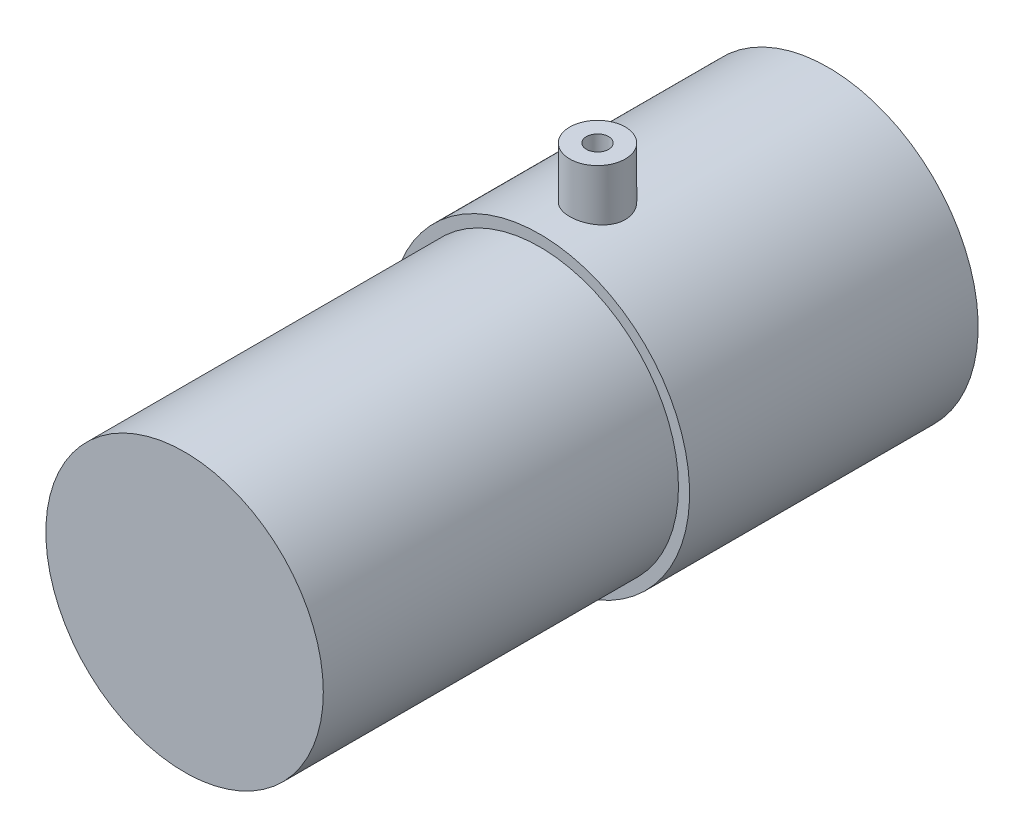
ISO-10303-21;
HEADER;
FILE_DESCRIPTION(('STEP AP214'),'2;1');
FILE_NAME('part.step','',(''),(''),'','','');
FILE_SCHEMA(('AUTOMOTIVE_DESIGN { 1 0 10303 214 1 1 1 1 }'));
ENDSEC;
DATA;
#1=APPLICATION_CONTEXT('core data for automotive mechanical design processes');
#2=APPLICATION_PROTOCOL_DEFINITION('international standard','automotive_design',2000,#1);
#3=PRODUCT_CONTEXT('',#1,'mechanical');
#4=PRODUCT('Part','Part','',(#3));
#5=PRODUCT_RELATED_PRODUCT_CATEGORY('part','',(#4));
#6=PRODUCT_DEFINITION_FORMATION('','',#4);
#7=PRODUCT_DEFINITION_CONTEXT('part definition',#1,'design');
#8=PRODUCT_DEFINITION('design','',#6,#7);
#9=PRODUCT_DEFINITION_SHAPE('','',#8);
#10=(LENGTH_UNIT() NAMED_UNIT(*) SI_UNIT(.MILLI.,.METRE.));
#11=(NAMED_UNIT(*) PLANE_ANGLE_UNIT() SI_UNIT($,.RADIAN.));
#12=(NAMED_UNIT(*) SI_UNIT($,.STERADIAN.) SOLID_ANGLE_UNIT());
#13=UNCERTAINTY_MEASURE_WITH_UNIT(LENGTH_MEASURE(1.E-05),#10,'distance_accuracy_value','');
#14=(GEOMETRIC_REPRESENTATION_CONTEXT(3) GLOBAL_UNCERTAINTY_ASSIGNED_CONTEXT((#13)) GLOBAL_UNIT_ASSIGNED_CONTEXT((#10,
#11,#12)) REPRESENTATION_CONTEXT('',''));
#15=CARTESIAN_POINT('',(0.,0.,0.));
#16=DIRECTION('',(0.,0.,1.));
#17=DIRECTION('',(1.,0.,0.));
#18=AXIS2_PLACEMENT_3D('',#15,#16,#17);
#19=CARTESIAN_POINT('',(0.,0.,0.));
#20=DIRECTION('',(0.,0.,1.));
#21=DIRECTION('',(1.,0.,0.));
#22=AXIS2_PLACEMENT_3D('',#19,#20,#21);
#23=PLANE('',#22);
#24=CARTESIAN_POINT('',(0.,0.,0.));
#25=DIRECTION('',(0.,0.,1.));
#26=DIRECTION('',(1.,0.,0.));
#27=AXIS2_PLACEMENT_3D('',#24,#25,#26);
#28=CIRCLE('',#27,1.);
#29=CARTESIAN_POINT('',(1.,0.,0.));
#30=VERTEX_POINT('',#29);
#31=EDGE_CURVE('E18',#30,#30,#28,.F.);
#32=ORIENTED_EDGE('',*,*,#31,.T.);
#33=EDGE_LOOP('',(#32));
#34=FACE_BOUND('',#33,.T.);
#35=ADVANCED_FACE('F15',(#34),#23,.F.);
#36=CARTESIAN_POINT('',(0.,0.,58.));
#37=DIRECTION('',(0.,0.,-1.));
#38=DIRECTION('',(-1.,0.,0.));
#39=AXIS2_PLACEMENT_3D('',#36,#37,#38);
#40=CYLINDRICAL_SURFACE('',#39,13.5);
#41=CARTESIAN_POINT('',(-7.28874342426864E-13,13.5,21.793969916197));
#42=CARTESIAN_POINT('',(0.0560547187778215,13.4999992255203,21.793965350852));
#43=CARTESIAN_POINT('',(0.112158286576555,13.4996470017555,21.7892393456204));
#44=CARTESIAN_POINT('',(0.222864894987266,13.4982743908674,21.7704407087432));
#45=CARTESIAN_POINT('',(0.277464499915154,13.4972525878948,21.7563482705365));
#46=CARTESIAN_POINT('',(0.383471550877165,13.4946566357918,21.7192259392802));
#47=CARTESIAN_POINT('',(0.434881875906202,13.4930829936095,21.696204247052));
#48=CARTESIAN_POINT('',(0.533083295219665,13.4895603799413,21.6418908434397));
#49=CARTESIAN_POINT('',(0.579876469092308,13.487611578607,21.6106028787952));
#50=CARTESIAN_POINT('',(0.667642209490378,13.4835526003134,21.5405698719629));
#51=CARTESIAN_POINT('',(0.708603537213994,13.4814421235002,21.5018107611579));
#52=CARTESIAN_POINT('',(0.783447763973924,13.4773001119936,21.417963488371));
#53=CARTESIAN_POINT('',(0.817330019927897,13.4752685844857,21.3728747520101));
#54=CARTESIAN_POINT('',(0.877086223697667,13.4715114384076,21.2775873611411));
#55=CARTESIAN_POINT('',(0.902951123598687,13.4697861663903,21.2273830177131));
#56=CARTESIAN_POINT('',(0.94588027163478,13.4668398746583,21.123329698313));
#57=CARTESIAN_POINT('',(0.962944722595264,13.4656188433223,21.0694808063695));
#58=CARTESIAN_POINT('',(0.987758440664013,13.4638214992336,20.9597720438277));
#59=CARTESIAN_POINT('',(0.995524858159425,13.4632439996121,20.9039160720331));
#60=CARTESIAN_POINT('',(1.00157500974734,13.4627952955316,20.7916904572035));
#61=CARTESIAN_POINT('',(0.999858870982531,13.4629240816027,20.735320821066));
#62=CARTESIAN_POINT('',(0.98700685017014,13.4638723229121,20.6237858446279));
#63=CARTESIAN_POINT('',(0.975889654976167,13.4646904079916,20.568618337792));
#64=CARTESIAN_POINT('',(0.944579934500234,13.4669229220615,20.4609340342315));
#65=CARTESIAN_POINT('',(0.924387252238211,13.468337361367,20.4084172833749));
#66=CARTESIAN_POINT('',(0.875477856895964,13.4716048357392,20.3074642984706));
#67=CARTESIAN_POINT('',(0.846752420833965,13.4734583192434,20.2590323056164));
#68=CARTESIAN_POINT('',(0.781601916279506,13.4773943974824,20.167674495549));
#69=CARTESIAN_POINT('',(0.745177372059709,13.4794769766123,20.1247483037367));
#70=CARTESIAN_POINT('',(0.665564669335613,13.4836424068129,20.0455149404205));
#71=CARTESIAN_POINT('',(0.622361678291855,13.4857252482279,20.00922267143));
#72=CARTESIAN_POINT('',(0.530445291464063,13.4896530825154,19.9443866893257));
#73=CARTESIAN_POINT('',(0.481729331139318,13.4914979638318,19.9158466035615));
#74=CARTESIAN_POINT('',(0.380143389175563,13.4947425193415,19.8673285849155));
#75=CARTESIAN_POINT('',(0.327269690363301,13.4961417893669,19.8473584192496));
#76=CARTESIAN_POINT('',(0.21899399506794,13.4983316458806,19.8166281855857));
#77=CARTESIAN_POINT('',(0.163597635331186,13.4991235250531,19.8058485522787));
#78=CARTESIAN_POINT('',(0.0719580842475888,13.4998561237979,19.7959102757375));
#79=CARTESIAN_POINT('',(0.0359891101357368,13.5000004972433,19.7939669850842));
#80=CARTESIAN_POINT('',(-0.0560547187785523,13.4999992255203,19.7939744815421));
#81=CARTESIAN_POINT('',(-0.112158286577282,13.4996470017555,19.7987004867738));
#82=CARTESIAN_POINT('',(-0.222864894987979,13.4982743908674,19.817499123651));
#83=CARTESIAN_POINT('',(-0.277464499915857,13.4972525878947,19.8315915618577));
#84=CARTESIAN_POINT('',(-0.383471550877841,13.4946566357918,19.8687138931142));
#85=CARTESIAN_POINT('',(-0.434881875906862,13.4930829936094,19.8917355853424));
#86=CARTESIAN_POINT('',(-0.533083295220286,13.4895603799413,19.9460489889548));
#87=CARTESIAN_POINT('',(-0.579876469092906,13.487611578607,19.9773369535993));
#88=CARTESIAN_POINT('',(-0.667642209490926,13.4835526003134,20.0473699604316));
#89=CARTESIAN_POINT('',(-0.708603537214513,13.4814421235002,20.0861290712367));
#90=CARTESIAN_POINT('',(-0.783447763974382,13.4773001119936,20.1699763440236));
#91=CARTESIAN_POINT('',(-0.817330019928321,13.4752685844857,20.2150650803846));
#92=CARTESIAN_POINT('',(-0.877086223698022,13.4715114384075,20.3103524712537));
#93=CARTESIAN_POINT('',(-0.902951123599006,13.4697861663903,20.3605568146816));
#94=CARTESIAN_POINT('',(-0.945880271635022,13.4668398746582,20.4646101340818));
#95=CARTESIAN_POINT('',(-0.962944722595466,13.4656188433222,20.5184590260252));
#96=CARTESIAN_POINT('',(-0.987758440664135,13.4638214992336,20.628167788567));
#97=CARTESIAN_POINT('',(-0.995524858159506,13.4632439996121,20.6840237603617));
#98=CARTESIAN_POINT('',(-1.00157500974733,13.4627952955316,20.7962493751913));
#99=CARTESIAN_POINT('',(-0.999858870982488,13.4629240816027,20.8526190113289));
#100=CARTESIAN_POINT('',(-0.987006850170015,13.4638723229121,20.9641539877669));
#101=CARTESIAN_POINT('',(-0.975889654976001,13.4646904079916,21.0193214946027));
#102=CARTESIAN_POINT('',(-0.94457993449999,13.4669229220615,21.1270057981632));
#103=CARTESIAN_POINT('',(-0.924387252237928,13.4683373613671,21.1795225490198));
#104=CARTESIAN_POINT('',(-0.875477856895607,13.4716048357392,21.2804755339241));
#105=CARTESIAN_POINT('',(-0.846752420833573,13.4734583192434,21.3289075267783));
#106=CARTESIAN_POINT('',(-0.781601916279047,13.4773943974824,21.4202653368456));
#107=CARTESIAN_POINT('',(-0.745177372059219,13.4794769766123,21.4631915286579));
#108=CARTESIAN_POINT('',(-0.665564669335064,13.483642406813,21.542424891974));
#109=CARTESIAN_POINT('',(-0.62236167829128,13.485725248228,21.5787171609645));
#110=CARTESIAN_POINT('',(-0.53044529146344,13.4896530825154,21.6435531430687));
#111=CARTESIAN_POINT('',(-0.481729331138673,13.4914979638319,21.6720932288329));
#112=CARTESIAN_POINT('',(-0.380143389174882,13.4947425193416,21.7206112474788));
#113=CARTESIAN_POINT('',(-0.327269690362606,13.4961417893669,21.7405814131447));
#114=CARTESIAN_POINT('',(-0.218993995067222,13.4983316458806,21.7713116468085));
#115=CARTESIAN_POINT('',(-0.163597635330461,13.4991235250532,21.7820912801155));
#116=CARTESIAN_POINT('',(-0.0719580842473417,13.4998561237979,21.7920295566565));
#117=CARTESIAN_POINT('',(-0.0359891101359786,13.5000004972433,21.7939728473099));
#118=CARTESIAN_POINT('',(-7.28874342426864E-13,13.5,21.793969916197));
#119=B_SPLINE_CURVE_WITH_KNOTS('',3,(#41,#42,#43,#44,#45,#46,#47,#48,#49,#50,#51,#52,#53,#54,
#55,#56,#57,#58,#59,#60,#61,#62,#63,#64,#65,#66,#67,#68,#69,#70,#71,#72,#73,#74,#75,#76,#77,#78,
#79,#80,#81,#82,#83,#84,#85,#86,#87,#88,#89,#90,#91,#92,#93,#94,#95,#96,#97,#98,#99,#100,#101,
#102,#103,#104,#105,#106,#107,#108,#109,#110,#111,#112,#113,#114,#115,#116,#117,#118),
.UNSPECIFIED.,.T.,.F.,(4,2,2,2,2,2,2,2,2,2,2,2,2,2,2,2,2,2,2,2,2,2,2,2,2,2,2,2,2,2,2,2,2,2,2,2,
2,2,4),(0.,0.168050403717357,0.336457307695583,0.504709907951301,0.672886377110588,
0.84138268223747,1.00989428738304,1.17859537816233,1.34729258068573,1.51567813645459,
1.68406143450504,1.85211081500111,2.02016310238446,2.18838778333214,2.35660101266711,
2.52518759461319,2.69385292510197,2.86267080162126,3.03112838556815,3.13902268277499,
3.30707308649235,3.47547999047058,3.64373259072629,3.81190905988558,3.98040536501247,
4.14891697015804,4.31761806093732,4.48631526346073,4.65470081922958,4.82308411728004,
4.99113349777611,5.15918578515945,5.32741046610714,5.4956236954421,5.66421027738819,
5.83287560787697,6.00169348439625,6.17015106834314,6.27804536554853),.UNSPECIFIED.);
#120=CARTESIAN_POINT('',(-7.28874342426864E-13,13.5,21.793969916197));
#121=VERTEX_POINT('',#120);
#122=EDGE_CURVE('E100',#121,#121,#119,.T.);
#123=ORIENTED_EDGE('',*,*,#122,.T.);
#124=EDGE_LOOP('',(#123));
#125=FACE_BOUND('',#124,.T.);
#126=ADVANCED_FACE('F105',(#125),#40,.T.);
#127=CARTESIAN_POINT('',(0.,0.,-4.));
#128=DIRECTION('',(0.,0.,1.));
#129=DIRECTION('',(1.,0.,0.));
#130=AXIS2_PLACEMENT_3D('',#127,#128,#129);
#131=CYLINDRICAL_SURFACE('',#130,1.);
#132=CARTESIAN_POINT('',(0.,0.,-4.));
#133=DIRECTION('',(0.,0.,1.));
#134=DIRECTION('',(1.,0.,0.));
#135=AXIS2_PLACEMENT_3D('',#132,#133,#134);
#136=CIRCLE('',#135,1.);
#137=CARTESIAN_POINT('',(1.,0.,-4.));
#138=VERTEX_POINT('',#137);
#139=EDGE_CURVE('E98',#138,#138,#136,.F.);
#140=ORIENTED_EDGE('',*,*,#139,.T.);
#141=EDGE_LOOP('',(#140));
#142=FACE_BOUND('',#141,.T.);
#143=ORIENTED_EDGE('',*,*,#31,.F.);
#144=EDGE_LOOP('',(#143));
#145=FACE_BOUND('',#144,.T.);
#146=ADVANCED_FACE('F113',(#142,#145),#131,.F.);
#147=CARTESIAN_POINT('',(0.,18.,20.793969916197));
#148=DIRECTION('',(0.,-1.,0.));
#149=DIRECTION('',(0.,0.,-1.));
#150=AXIS2_PLACEMENT_3D('',#147,#148,#149);
#151=CYLINDRICAL_SURFACE('',#150,1.);
#152=CARTESIAN_POINT('',(0.,18.,20.793969916197));
#153=DIRECTION('',(0.,-1.,0.));
#154=DIRECTION('',(0.,0.,-1.));
#155=AXIS2_PLACEMENT_3D('',#152,#153,#154);
#156=CIRCLE('',#155,1.);
#157=CARTESIAN_POINT('',(0.,18.,19.793969916197));
#158=VERTEX_POINT('',#157);
#159=EDGE_CURVE('E93',#158,#158,#156,.T.);
#160=ORIENTED_EDGE('',*,*,#159,.F.);
#161=EDGE_LOOP('',(#160));
#162=FACE_BOUND('',#161,.T.);
#163=ORIENTED_EDGE('',*,*,#122,.F.);
#164=EDGE_LOOP('',(#163));
#165=FACE_BOUND('',#164,.T.);
#166=ADVANCED_FACE('F108',(#162,#165),#151,.F.);
#167=CARTESIAN_POINT('',(0.,0.,-4.));
#168=DIRECTION('',(0.,0.,1.));
#169=DIRECTION('',(1.,0.,0.));
#170=AXIS2_PLACEMENT_3D('',#167,#168,#169);
#171=PLANE('',#170);
#172=CARTESIAN_POINT('',(0.,0.,-4.));
#173=DIRECTION('',(0.,0.,1.));
#174=DIRECTION('',(1.,0.,0.));
#175=AXIS2_PLACEMENT_3D('',#172,#173,#174);
#176=CIRCLE('',#175,2.5);
#177=CARTESIAN_POINT('',(2.5,0.,-4.));
#178=VERTEX_POINT('',#177);
#179=EDGE_CURVE('E90',#178,#178,#176,.T.);
#180=ORIENTED_EDGE('',*,*,#179,.F.);
#181=EDGE_LOOP('',(#180));
#182=FACE_BOUND('',#181,.T.);
#183=ORIENTED_EDGE('',*,*,#139,.F.);
#184=EDGE_LOOP('',(#183));
#185=FACE_BOUND('',#184,.T.);
#186=ADVANCED_FACE('F112',(#182,#185),#171,.F.);
#187=CARTESIAN_POINT('',(0.,18.,20.793969916197));
#188=DIRECTION('',(0.,1.,0.));
#189=DIRECTION('',(0.,0.,1.));
#190=AXIS2_PLACEMENT_3D('',#187,#188,#189);
#191=PLANE('',#190);
#192=ORIENTED_EDGE('',*,*,#159,.T.);
#193=EDGE_LOOP('',(#192));
#194=FACE_BOUND('',#193,.T.);
#195=CARTESIAN_POINT('',(0.,18.,20.793969916197));
#196=DIRECTION('',(0.,-1.,0.));
#197=DIRECTION('',(0.,0.,-1.));
#198=AXIS2_PLACEMENT_3D('',#195,#196,#197);
#199=CIRCLE('',#198,2.5);
#200=CARTESIAN_POINT('',(0.,18.,18.293969916197));
#201=VERTEX_POINT('',#200);
#202=EDGE_CURVE('E88',#201,#201,#199,.T.);
#203=ORIENTED_EDGE('',*,*,#202,.F.);
#204=EDGE_LOOP('',(#203));
#205=FACE_BOUND('',#204,.T.);
#206=ADVANCED_FACE('F158',(#194,#205),#191,.T.);
#207=CARTESIAN_POINT('',(0.,0.,-4.));
#208=DIRECTION('',(0.,0.,1.));
#209=DIRECTION('',(1.,0.,0.));
#210=AXIS2_PLACEMENT_3D('',#207,#208,#209);
#211=CYLINDRICAL_SURFACE('',#210,2.5);
#212=CARTESIAN_POINT('',(0.,0.,0.));
#213=DIRECTION('',(0.,0.,1.));
#214=DIRECTION('',(1.,0.,0.));
#215=AXIS2_PLACEMENT_3D('',#212,#213,#214);
#216=CIRCLE('',#215,2.5);
#217=CARTESIAN_POINT('',(2.5,0.,0.));
#218=VERTEX_POINT('',#217);
#219=EDGE_CURVE('E42',#218,#218,#216,.F.);
#220=ORIENTED_EDGE('',*,*,#219,.T.);
#221=EDGE_LOOP('',(#220));
#222=FACE_BOUND('',#221,.T.);
#223=ORIENTED_EDGE('',*,*,#179,.T.);
#224=EDGE_LOOP('',(#223));
#225=FACE_BOUND('',#224,.T.);
#226=ADVANCED_FACE('F62',(#222,#225),#211,.T.);
#227=CARTESIAN_POINT('',(0.,18.,20.793969916197));
#228=DIRECTION('',(0.,-1.,0.));
#229=DIRECTION('',(0.,0.,-1.));
#230=AXIS2_PLACEMENT_3D('',#227,#228,#229);
#231=CYLINDRICAL_SURFACE('',#230,2.5);
#232=CARTESIAN_POINT('',(0.,13.5,18.293969916197));
#233=CARTESIAN_POINT('',(0.139010330816084,13.4999970311911,18.2939764627643));
#234=CARTESIAN_POINT('',(0.278195450523743,13.4978287383152,18.3056137882832));
#235=CARTESIAN_POINT('',(0.552753980482643,13.4893816276427,18.3518571768367));
#236=CARTESIAN_POINT('',(0.68811918918217,13.4830945773857,18.3865092430294));
#237=CARTESIAN_POINT('',(0.950866122062068,13.4671137183626,18.4776897820171));
#238=CARTESIAN_POINT('',(1.07825825225281,13.4574244640223,18.5341890188629));
#239=CARTESIAN_POINT('',(1.32170467279864,13.435700641519,18.6673880885624));
#240=CARTESIAN_POINT('',(1.43776291414699,13.4236668950586,18.7440808472466));
#241=CARTESIAN_POINT('',(1.65667259724452,13.3984223332887,18.9164589585478));
#242=CARTESIAN_POINT('',(1.75937129719354,13.385200410267,19.0123366932919));
#243=CARTESIAN_POINT('',(1.94732762423934,13.3591519492264,19.2199537076974));
#244=CARTESIAN_POINT('',(2.03258310075633,13.346325460126,19.3316949403006));
#245=CARTESIAN_POINT('',(2.18385108499362,13.322414356896,19.5689258066487));
#246=CARTESIAN_POINT('',(2.2497106811683,13.3113438860517,19.6945144941154));
#247=CARTESIAN_POINT('',(2.35933780186042,13.2923527011429,19.955211706631));
#248=CARTESIAN_POINT('',(2.40310737173842,13.2844316954774,20.0903193489797));
#249=CARTESIAN_POINT('',(2.4668286370401,13.2727466780754,20.3646042290421));
#250=CARTESIAN_POINT('',(2.48704369764998,13.2689367364757,20.5037182870389));
#251=CARTESIAN_POINT('',(2.50389946105268,13.2657666998031,20.7834119923532));
#252=CARTESIAN_POINT('',(2.50054218792397,13.2664062226694,20.9239915128011));
#253=CARTESIAN_POINT('',(2.47056231532448,13.2720210160685,21.2007193709116));
#254=CARTESIAN_POINT('',(2.44423896890885,13.2769405152416,21.3369014272764));
#255=CARTESIAN_POINT('',(2.36954489138673,13.2904734532506,21.6028834208658));
#256=CARTESIAN_POINT('',(2.32117307050359,13.2990870746723,21.7326830422782));
#257=CARTESIAN_POINT('',(2.20345946262748,13.3190965663922,21.9830963333649));
#258=CARTESIAN_POINT('',(2.13399578338635,13.3305085328372,22.1036513646814));
#259=CARTESIAN_POINT('',(1.976162087989,13.3548170655939,22.3314980266501));
#260=CARTESIAN_POINT('',(1.88779162084947,13.3677136673153,22.4387893408267));
#261=CARTESIAN_POINT('',(1.69305471588918,13.3937799585613,22.6387842720225));
#262=CARTESIAN_POINT('',(1.58643540584958,13.4069508213243,22.7312416582059));
#263=CARTESIAN_POINT('',(1.35901424676757,13.4319076924485,22.8970355787372));
#264=CARTESIAN_POINT('',(1.2382061517741,13.4436930863194,22.9703636461976));
#265=CARTESIAN_POINT('',(0.985550322864072,13.4645752934056,23.0958467526198));
#266=CARTESIAN_POINT('',(0.853681139036289,13.4736667201809,23.1479594493135));
#267=CARTESIAN_POINT('',(0.583026163002697,13.4880816003061,23.2291214718633));
#268=CARTESIAN_POINT('',(0.444255577837854,13.4934129765303,23.2582193085932));
#269=CARTESIAN_POINT('',(0.25371050158354,13.4977111478307,23.2815845517629));
#270=CARTESIAN_POINT('',(0.203090191659828,13.4985675874693,23.2862251925749));
#271=CARTESIAN_POINT('',(0.101654380712734,13.4997125567483,23.292419073625));
#272=CARTESIAN_POINT('',(0.0508388794710209,13.5000010857532,23.2939723104086));
#273=CARTESIAN_POINT('',(-0.139010330816085,13.4999970311911,23.2939633696297));
#274=CARTESIAN_POINT('',(-0.278195450523743,13.4978287383152,23.2823260441109));
#275=CARTESIAN_POINT('',(-0.552753980482643,13.4893816276427,23.2360826555574));
#276=CARTESIAN_POINT('',(-0.688119189182171,13.4830945773857,23.2014305893647));
#277=CARTESIAN_POINT('',(-0.950866122062068,13.4671137183626,23.1102500503769));
#278=CARTESIAN_POINT('',(-1.07825825225281,13.4574244640223,23.0537508135312));
#279=CARTESIAN_POINT('',(-1.32170467279864,13.435700641519,22.9205517438316));
#280=CARTESIAN_POINT('',(-1.43776291414699,13.4236668950586,22.8438589851475));
#281=CARTESIAN_POINT('',(-1.65667259724452,13.3984223332887,22.6714808738463));
#282=CARTESIAN_POINT('',(-1.75937129719354,13.385200410267,22.5756031391022));
#283=CARTESIAN_POINT('',(-1.94732762423934,13.3591519492264,22.3679861246967));
#284=CARTESIAN_POINT('',(-2.03258310075633,13.346325460126,22.2562448920935));
#285=CARTESIAN_POINT('',(-2.18385108499362,13.322414356896,22.0190140257454));
#286=CARTESIAN_POINT('',(-2.2497106811683,13.3113438860517,21.8934253382787));
#287=CARTESIAN_POINT('',(-2.35933780186042,13.2923527011429,21.6327281257631));
#288=CARTESIAN_POINT('',(-2.40310737173842,13.2844316954774,21.4976204834143));
#289=CARTESIAN_POINT('',(-2.4668286370401,13.2727466780754,21.223335603352));
#290=CARTESIAN_POINT('',(-2.48704369764998,13.2689367364757,21.0842215453551));
#291=CARTESIAN_POINT('',(-2.50389946105268,13.2657666998031,20.8045278400409));
#292=CARTESIAN_POINT('',(-2.50054218792397,13.2664062226694,20.663948319593));
#293=CARTESIAN_POINT('',(-2.47056231532448,13.2720210160685,20.3872204614824));
#294=CARTESIAN_POINT('',(-2.44423896890885,13.2769405152416,20.2510384051176));
#295=CARTESIAN_POINT('',(-2.36954489138673,13.2904734532506,19.9850564115283));
#296=CARTESIAN_POINT('',(-2.32117307050359,13.2990870746723,19.8552567901159));
#297=CARTESIAN_POINT('',(-2.20345946262748,13.3190965663922,19.6048434990291));
#298=CARTESIAN_POINT('',(-2.13399578338635,13.3305085328372,19.4842884677126));
#299=CARTESIAN_POINT('',(-1.976162087989,13.3548170655939,19.256441805744));
#300=CARTESIAN_POINT('',(-1.88779162084947,13.3677136673153,19.1491504915674));
#301=CARTESIAN_POINT('',(-1.69305471588918,13.3937799585613,18.9491555603716));
#302=CARTESIAN_POINT('',(-1.58643540584958,13.4069508213243,18.8566981741882));
#303=CARTESIAN_POINT('',(-1.35901424676757,13.4319076924485,18.6909042536569));
#304=CARTESIAN_POINT('',(-1.2382061517741,13.4436930863194,18.6175761861964));
#305=CARTESIAN_POINT('',(-0.985550322864072,13.4645752934056,18.4920930797743));
#306=CARTESIAN_POINT('',(-0.853681139036288,13.4736667201809,18.4399803830806));
#307=CARTESIAN_POINT('',(-0.583026163002696,13.4880816003061,18.3588183605308));
#308=CARTESIAN_POINT('',(-0.444255577837853,13.4934129765303,18.3297205238009));
#309=CARTESIAN_POINT('',(-0.25371050158354,13.4977111478307,18.3063552806311));
#310=CARTESIAN_POINT('',(-0.203090191659828,13.4985675874693,18.3017146398191));
#311=CARTESIAN_POINT('',(-0.101654380712734,13.4997125567483,18.2955207587691));
#312=CARTESIAN_POINT('',(-0.050838879471021,13.5000010857532,18.2939675219854));
#313=CARTESIAN_POINT('',(0.,13.5,18.293969916197));
#314=B_SPLINE_CURVE_WITH_KNOTS('',3,(#232,#233,#234,#235,#236,#237,#238,#239,#240,#241,#242,
#243,#244,#245,#246,#247,#248,#249,#250,#251,#252,#253,#254,#255,#256,#257,#258,#259,#260,#261,
#262,#263,#264,#265,#266,#267,#268,#269,#270,#271,#272,#273,#274,#275,#276,#277,#278,#279,#280,
#281,#282,#283,#284,#285,#286,#287,#288,#289,#290,#291,#292,#293,#294,#295,#296,#297,#298,#299,
#300,#301,#302,#303,#304,#305,#306,#307,#308,#309,#310,#311,#312,#313),.UNSPECIFIED.,.T.,.F.,(4,
2,2,2,2,2,2,2,2,2,2,2,2,2,2,2,2,2,2,2,2,2,2,2,2,2,2,2,2,2,2,2,2,2,2,2,2,2,2,2,4),(0.,
0.416836773806885,0.834509262094903,1.25162474339648,1.66859429528348,2.08997598983961,
2.51140960539561,2.93608181952667,3.36071470517436,3.78055273349158,4.20035471214437,
4.61476692298868,5.02919961895675,5.44607448691829,5.86295929969863,6.28617397037682,
6.70957564481503,7.13381826230498,7.55716425749488,7.70960969566914,7.86205530441094,
8.27889207821782,8.69656456650584,9.11368004780742,9.53064959969442,9.95203129425055,
10.3734649098065,10.7981371239376,11.2227700095853,11.6426080379025,12.0624100165553,
12.4768222273996,12.8912549233677,13.3081297913292,13.7250146041096,14.1482292747878,
14.571630949226,14.9958735667159,15.4192195619058,15.5716650000801,15.7241106088219),.UNSPECIFIED.);
#315=CARTESIAN_POINT('',(0.,13.5,18.293969916197));
#316=VERTEX_POINT('',#315);
#317=EDGE_CURVE('E35',#316,#316,#314,.T.);
#318=ORIENTED_EDGE('',*,*,#317,.F.);
#319=EDGE_LOOP('',(#318));
#320=FACE_BOUND('',#319,.T.);
#321=ORIENTED_EDGE('',*,*,#202,.T.);
#322=EDGE_LOOP('',(#321));
#323=FACE_BOUND('',#322,.T.);
#324=ADVANCED_FACE('F44',(#320,#323),#231,.T.);
#325=CARTESIAN_POINT('',(0.,0.,0.));
#326=DIRECTION('',(0.,0.,1.));
#327=DIRECTION('',(1.,0.,0.));
#328=AXIS2_PLACEMENT_3D('',#325,#326,#327);
#329=PLANE('',#328);
#330=CARTESIAN_POINT('',(0.,0.,0.));
#331=DIRECTION('',(0.,0.,-1.));
#332=DIRECTION('',(-1.,0.,0.));
#333=AXIS2_PLACEMENT_3D('',#330,#331,#332);
#334=CIRCLE('',#333,13.5);
#335=CARTESIAN_POINT('',(-13.5,0.,0.));
#336=VERTEX_POINT('',#335);
#337=EDGE_CURVE('E32',#336,#336,#334,.F.);
#338=ORIENTED_EDGE('',*,*,#337,.F.);
#339=EDGE_LOOP('',(#338));
#340=FACE_BOUND('',#339,.T.);
#341=ORIENTED_EDGE('',*,*,#219,.F.);
#342=EDGE_LOOP('',(#341));
#343=FACE_BOUND('',#342,.T.);
#344=ADVANCED_FACE('F53',(#340,#343),#329,.F.);
#345=CARTESIAN_POINT('',(0.,0.,58.));
#346=DIRECTION('',(0.,0.,-1.));
#347=DIRECTION('',(-1.,0.,0.));
#348=AXIS2_PLACEMENT_3D('',#345,#346,#347);
#349=CYLINDRICAL_SURFACE('',#348,13.5);
#350=ORIENTED_EDGE('',*,*,#337,.T.);
#351=EDGE_LOOP('',(#350));
#352=FACE_BOUND('',#351,.T.);
#353=CARTESIAN_POINT('',(0.,0.,26.));
#354=DIRECTION('',(0.,0.,-1.));
#355=DIRECTION('',(-1.,0.,0.));
#356=AXIS2_PLACEMENT_3D('',#353,#354,#355);
#357=CIRCLE('',#356,13.5);
#358=CARTESIAN_POINT('',(-13.5,0.,26.));
#359=VERTEX_POINT('',#358);
#360=EDGE_CURVE('E27',#359,#359,#357,.F.);
#361=ORIENTED_EDGE('',*,*,#360,.F.);
#362=EDGE_LOOP('',(#361));
#363=FACE_BOUND('',#362,.T.);
#364=ORIENTED_EDGE('',*,*,#317,.T.);
#365=EDGE_LOOP('',(#364));
#366=FACE_BOUND('',#365,.T.);
#367=ADVANCED_FACE('F48',(#352,#363,#366),#349,.T.);
#368=CARTESIAN_POINT('',(0.,0.,26.));
#369=DIRECTION('',(0.,0.,1.));
#370=DIRECTION('',(1.,0.,0.));
#371=AXIS2_PLACEMENT_3D('',#368,#369,#370);
#372=PLANE('',#371);
#373=ORIENTED_EDGE('',*,*,#360,.T.);
#374=EDGE_LOOP('',(#373));
#375=FACE_BOUND('',#374,.T.);
#376=CARTESIAN_POINT('',(0.,0.,26.));
#377=DIRECTION('',(0.,0.,1.));
#378=DIRECTION('',(1.,0.,0.));
#379=AXIS2_PLACEMENT_3D('',#376,#377,#378);
#380=CIRCLE('',#379,12.5);
#381=CARTESIAN_POINT('',(12.5,0.,26.));
#382=VERTEX_POINT('',#381);
#383=EDGE_CURVE('E22',#382,#382,#380,.T.);
#384=ORIENTED_EDGE('',*,*,#383,.F.);
#385=EDGE_LOOP('',(#384));
#386=FACE_BOUND('',#385,.T.);
#387=ADVANCED_FACE('F52',(#375,#386),#372,.T.);
#388=CARTESIAN_POINT('',(0.,0.,58.));
#389=DIRECTION('',(0.,0.,1.));
#390=DIRECTION('',(1.,0.,0.));
#391=AXIS2_PLACEMENT_3D('',#388,#389,#390);
#392=PLANE('',#391);
#393=CARTESIAN_POINT('',(0.,0.,58.));
#394=DIRECTION('',(0.,0.,1.));
#395=DIRECTION('',(1.,0.,0.));
#396=AXIS2_PLACEMENT_3D('',#393,#394,#395);
#397=CIRCLE('',#396,12.5);
#398=CARTESIAN_POINT('',(12.5,0.,58.));
#399=VERTEX_POINT('',#398);
#400=EDGE_CURVE('E10',#399,#399,#397,.F.);
#401=ORIENTED_EDGE('',*,*,#400,.F.);
#402=EDGE_LOOP('',(#401));
#403=FACE_BOUND('',#402,.T.);
#404=ADVANCED_FACE('F68',(#403),#392,.T.);
#405=CARTESIAN_POINT('',(0.,0.,26.));
#406=DIRECTION('',(0.,0.,1.));
#407=DIRECTION('',(1.,0.,0.));
#408=AXIS2_PLACEMENT_3D('',#405,#406,#407);
#409=CYLINDRICAL_SURFACE('',#408,12.5);
#410=ORIENTED_EDGE('',*,*,#400,.T.);
#411=EDGE_LOOP('',(#410));
#412=FACE_BOUND('',#411,.T.);
#413=ORIENTED_EDGE('',*,*,#383,.T.);
#414=EDGE_LOOP('',(#413));
#415=FACE_BOUND('',#414,.T.);
#416=ADVANCED_FACE('F66',(#412,#415),#409,.T.);
#417=CLOSED_SHELL('',(#35,#126,#146,#166,#186,#206,#226,#324,#344,#367,#387,#404,#416));
#418=MANIFOLD_SOLID_BREP('B1',#417);
#419=ADVANCED_BREP_SHAPE_REPRESENTATION('',(#18,#418),#14);
#420=SHAPE_DEFINITION_REPRESENTATION(#9,#419);
ENDSEC;
END-ISO-10303-21;
